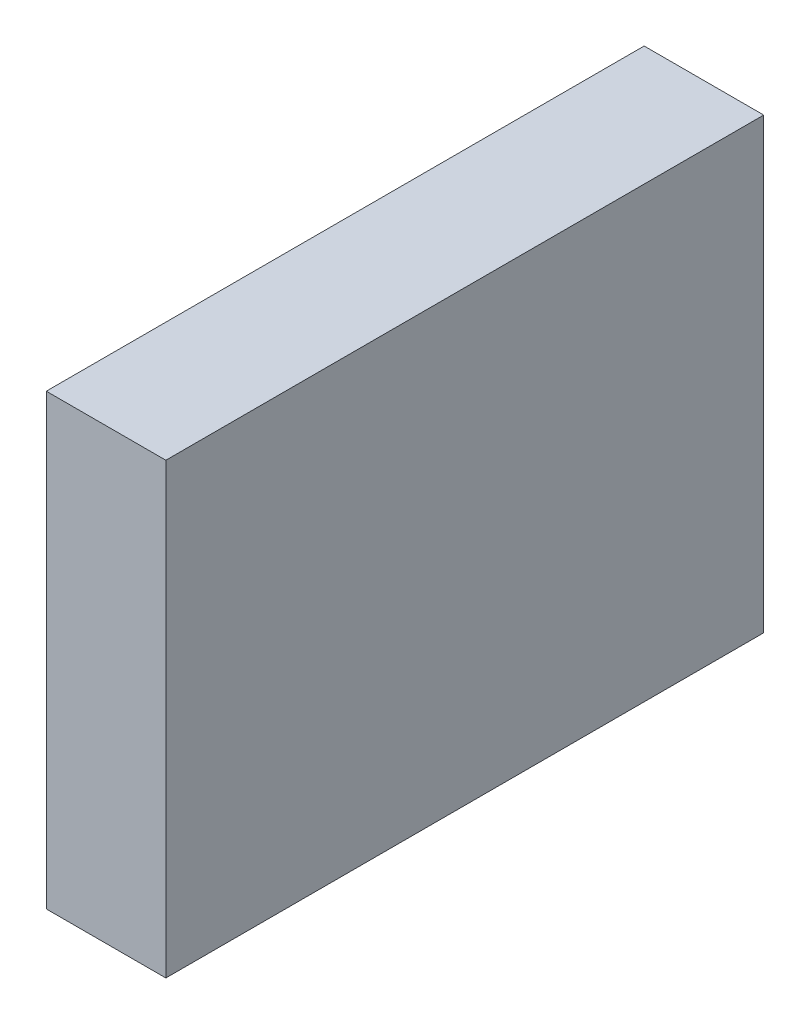
ISO-10303-21;
HEADER;
FILE_DESCRIPTION(('STEP AP214'),'2;1');
FILE_NAME('part.step','',(''),(''),'','','');
FILE_SCHEMA(('AUTOMOTIVE_DESIGN { 1 0 10303 214 1 1 1 1 }'));
ENDSEC;
DATA;
#1=APPLICATION_CONTEXT('core data for automotive mechanical design processes');
#2=APPLICATION_PROTOCOL_DEFINITION('international standard','automotive_design',2000,#1);
#3=PRODUCT_CONTEXT('',#1,'mechanical');
#4=PRODUCT('Part','Part','',(#3));
#5=PRODUCT_RELATED_PRODUCT_CATEGORY('part','',(#4));
#6=PRODUCT_DEFINITION_FORMATION('','',#4);
#7=PRODUCT_DEFINITION_CONTEXT('part definition',#1,'design');
#8=PRODUCT_DEFINITION('design','',#6,#7);
#9=PRODUCT_DEFINITION_SHAPE('','',#8);
#10=(LENGTH_UNIT() NAMED_UNIT(*) SI_UNIT(.MILLI.,.METRE.));
#11=(NAMED_UNIT(*) PLANE_ANGLE_UNIT() SI_UNIT($,.RADIAN.));
#12=(NAMED_UNIT(*) SI_UNIT($,.STERADIAN.) SOLID_ANGLE_UNIT());
#13=UNCERTAINTY_MEASURE_WITH_UNIT(LENGTH_MEASURE(1.E-05),#10,'distance_accuracy_value','');
#14=(GEOMETRIC_REPRESENTATION_CONTEXT(3) GLOBAL_UNCERTAINTY_ASSIGNED_CONTEXT((#13)) GLOBAL_UNIT_ASSIGNED_CONTEXT((#10,
#11,#12)) REPRESENTATION_CONTEXT('',''));
#15=CARTESIAN_POINT('',(0.,0.,0.));
#16=DIRECTION('',(0.,0.,1.));
#17=DIRECTION('',(1.,0.,0.));
#18=AXIS2_PLACEMENT_3D('',#15,#16,#17);
#19=CARTESIAN_POINT('',(-20.,150.,-100.));
#20=DIRECTION('',(1.,0.,0.));
#21=DIRECTION('',(0.,0.,-1.));
#22=AXIS2_PLACEMENT_3D('',#19,#20,#21);
#23=PLANE('',#22);
#24=DIRECTION('',(0.,0.,1.));
#25=VECTOR('',#24,1.);
#26=CARTESIAN_POINT('',(-20.,0.,-100.));
#27=LINE('',#26,#25);
#28=CARTESIAN_POINT('',(-20.,0.,-100.));
#29=VERTEX_POINT('',#28);
#30=CARTESIAN_POINT('',(-20.,0.,100.));
#31=VERTEX_POINT('',#30);
#32=EDGE_CURVE('E96',#29,#31,#27,.T.);
#33=ORIENTED_EDGE('',*,*,#32,.T.);
#34=DIRECTION('',(0.,-1.,0.));
#35=VECTOR('',#34,1.);
#36=CARTESIAN_POINT('',(-20.,150.,100.));
#37=LINE('',#36,#35);
#38=CARTESIAN_POINT('',(-20.,150.,100.));
#39=VERTEX_POINT('',#38);
#40=EDGE_CURVE('E11',#39,#31,#37,.T.);
#41=ORIENTED_EDGE('',*,*,#40,.F.);
#42=DIRECTION('',(0.,0.,1.));
#43=VECTOR('',#42,1.);
#44=CARTESIAN_POINT('',(-20.,150.,-100.));
#45=LINE('',#44,#43);
#46=CARTESIAN_POINT('',(-20.,150.,-100.));
#47=VERTEX_POINT('',#46);
#48=EDGE_CURVE('E84',#47,#39,#45,.T.);
#49=ORIENTED_EDGE('',*,*,#48,.F.);
#50=DIRECTION('',(0.,-1.,0.));
#51=VECTOR('',#50,1.);
#52=CARTESIAN_POINT('',(-20.,150.,-100.));
#53=LINE('',#52,#51);
#54=EDGE_CURVE('E92',#47,#29,#53,.T.);
#55=ORIENTED_EDGE('',*,*,#54,.T.);
#56=EDGE_LOOP('',(#33,#41,#49,#55));
#57=FACE_BOUND('',#56,.T.);
#58=ADVANCED_FACE('F33',(#57),#23,.F.);
#59=CARTESIAN_POINT('',(20.,150.,100.));
#60=DIRECTION('',(0.,0.,-1.));
#61=DIRECTION('',(-1.,0.,0.));
#62=AXIS2_PLACEMENT_3D('',#59,#60,#61);
#63=PLANE('',#62);
#64=DIRECTION('',(1.,0.,0.));
#65=VECTOR('',#64,1.);
#66=CARTESIAN_POINT('',(20.,0.,100.));
#67=LINE('',#66,#65);
#68=CARTESIAN_POINT('',(20.,0.,100.));
#69=VERTEX_POINT('',#68);
#70=EDGE_CURVE('E88',#31,#69,#67,.T.);
#71=ORIENTED_EDGE('',*,*,#70,.T.);
#72=DIRECTION('',(0.,-1.,0.));
#73=VECTOR('',#72,1.);
#74=CARTESIAN_POINT('',(20.,150.,100.));
#75=LINE('',#74,#73);
#76=CARTESIAN_POINT('',(20.,150.,100.));
#77=VERTEX_POINT('',#76);
#78=EDGE_CURVE('E41',#77,#69,#75,.T.);
#79=ORIENTED_EDGE('',*,*,#78,.F.);
#80=DIRECTION('',(1.,0.,0.));
#81=VECTOR('',#80,1.);
#82=CARTESIAN_POINT('',(20.,150.,100.));
#83=LINE('',#82,#81);
#84=EDGE_CURVE('E79',#39,#77,#83,.T.);
#85=ORIENTED_EDGE('',*,*,#84,.F.);
#86=ORIENTED_EDGE('',*,*,#40,.T.);
#87=EDGE_LOOP('',(#71,#79,#85,#86));
#88=FACE_BOUND('',#87,.T.);
#89=ADVANCED_FACE('F87',(#88),#63,.F.);
#90=CARTESIAN_POINT('',(20.,150.,-99.9999999999999));
#91=DIRECTION('',(-1.,0.,0.));
#92=DIRECTION('',(0.,0.,1.));
#93=AXIS2_PLACEMENT_3D('',#90,#91,#92);
#94=PLANE('',#93);
#95=DIRECTION('',(0.,0.,-1.));
#96=VECTOR('',#95,1.);
#97=CARTESIAN_POINT('',(20.,0.,-99.9999999999999));
#98=LINE('',#97,#96);
#99=CARTESIAN_POINT('',(20.,0.,-99.9999999999999));
#100=VERTEX_POINT('',#99);
#101=EDGE_CURVE('E66',#69,#100,#98,.T.);
#102=ORIENTED_EDGE('',*,*,#101,.T.);
#103=DIRECTION('',(0.,-1.,0.));
#104=VECTOR('',#103,1.);
#105=CARTESIAN_POINT('',(20.,150.,-99.9999999999999));
#106=LINE('',#105,#104);
#107=CARTESIAN_POINT('',(20.,150.,-99.9999999999999));
#108=VERTEX_POINT('',#107);
#109=EDGE_CURVE('E89',#108,#100,#106,.T.);
#110=ORIENTED_EDGE('',*,*,#109,.F.);
#111=DIRECTION('',(0.,0.,-1.));
#112=VECTOR('',#111,1.);
#113=CARTESIAN_POINT('',(20.,150.,-99.9999999999999));
#114=LINE('',#113,#112);
#115=EDGE_CURVE('E82',#77,#108,#114,.T.);
#116=ORIENTED_EDGE('',*,*,#115,.F.);
#117=ORIENTED_EDGE('',*,*,#78,.T.);
#118=EDGE_LOOP('',(#102,#110,#116,#117));
#119=FACE_BOUND('',#118,.T.);
#120=ADVANCED_FACE('F90',(#119),#94,.F.);
#121=CARTESIAN_POINT('',(20.,150.,-99.9999999999999));
#122=DIRECTION('',(0.,0.,1.));
#123=DIRECTION('',(1.,0.,0.));
#124=AXIS2_PLACEMENT_3D('',#121,#122,#123);
#125=PLANE('',#124);
#126=DIRECTION('',(-1.,0.,0.));
#127=VECTOR('',#126,1.);
#128=CARTESIAN_POINT('',(20.,0.,-99.9999999999999));
#129=LINE('',#128,#127);
#130=EDGE_CURVE('E72',#100,#29,#129,.T.);
#131=ORIENTED_EDGE('',*,*,#130,.T.);
#132=ORIENTED_EDGE('',*,*,#54,.F.);
#133=DIRECTION('',(-1.,0.,0.));
#134=VECTOR('',#133,1.);
#135=CARTESIAN_POINT('',(20.,150.,-99.9999999999999));
#136=LINE('',#135,#134);
#137=EDGE_CURVE('E49',#108,#47,#136,.T.);
#138=ORIENTED_EDGE('',*,*,#137,.F.);
#139=ORIENTED_EDGE('',*,*,#109,.T.);
#140=EDGE_LOOP('',(#131,#132,#138,#139));
#141=FACE_BOUND('',#140,.T.);
#142=ADVANCED_FACE('F103',(#141),#125,.F.);
#143=CARTESIAN_POINT('',(0.,150.,0.));
#144=DIRECTION('',(0.,-1.,0.));
#145=DIRECTION('',(0.,0.,-1.));
#146=AXIS2_PLACEMENT_3D('',#143,#144,#145);
#147=PLANE('',#146);
#148=ORIENTED_EDGE('',*,*,#48,.T.);
#149=ORIENTED_EDGE('',*,*,#84,.T.);
#150=ORIENTED_EDGE('',*,*,#115,.T.);
#151=ORIENTED_EDGE('',*,*,#137,.T.);
#152=EDGE_LOOP('',(#148,#149,#150,#151));
#153=FACE_BOUND('',#152,.T.);
#154=ADVANCED_FACE('F80',(#153),#147,.F.);
#155=CARTESIAN_POINT('',(0.,0.,0.));
#156=DIRECTION('',(0.,-1.,0.));
#157=DIRECTION('',(0.,0.,-1.));
#158=AXIS2_PLACEMENT_3D('',#155,#156,#157);
#159=PLANE('',#158);
#160=ORIENTED_EDGE('',*,*,#32,.F.);
#161=ORIENTED_EDGE('',*,*,#130,.F.);
#162=ORIENTED_EDGE('',*,*,#101,.F.);
#163=ORIENTED_EDGE('',*,*,#70,.F.);
#164=EDGE_LOOP('',(#160,#161,#162,#163));
#165=FACE_BOUND('',#164,.T.);
#166=ADVANCED_FACE('F106',(#165),#159,.T.);
#167=CLOSED_SHELL('',(#58,#89,#120,#142,#154,#166));
#168=MANIFOLD_SOLID_BREP('B2',#167);
#169=ADVANCED_BREP_SHAPE_REPRESENTATION('',(#18,#168),#14);
#170=SHAPE_DEFINITION_REPRESENTATION(#9,#169);
ENDSEC;
END-ISO-10303-21;
